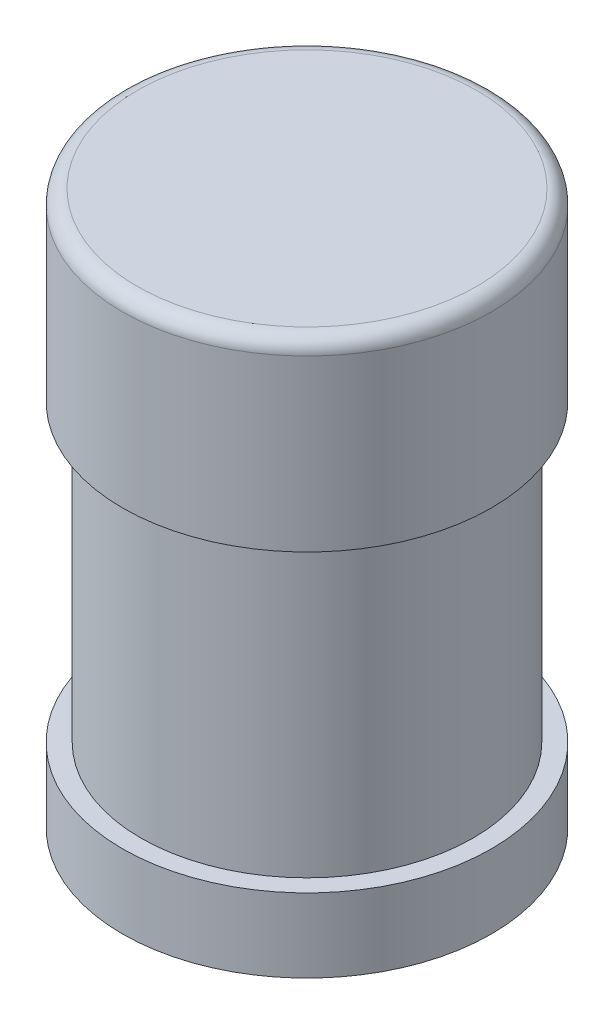
ISO-10303-21;
HEADER;
FILE_DESCRIPTION(('STEP AP214'),'2;1');
FILE_NAME('part.step','',(''),(''),'','','');
FILE_SCHEMA(('AUTOMOTIVE_DESIGN { 1 0 10303 214 1 1 1 1 }'));
ENDSEC;
DATA;
#1=APPLICATION_CONTEXT('core data for automotive mechanical design processes');
#2=APPLICATION_PROTOCOL_DEFINITION('international standard','automotive_design',2000,#1);
#3=PRODUCT_CONTEXT('',#1,'mechanical');
#4=PRODUCT('Part','Part','',(#3));
#5=PRODUCT_RELATED_PRODUCT_CATEGORY('part','',(#4));
#6=PRODUCT_DEFINITION_FORMATION('','',#4);
#7=PRODUCT_DEFINITION_CONTEXT('part definition',#1,'design');
#8=PRODUCT_DEFINITION('design','',#6,#7);
#9=PRODUCT_DEFINITION_SHAPE('','',#8);
#10=(LENGTH_UNIT() NAMED_UNIT(*) SI_UNIT(.MILLI.,.METRE.));
#11=(NAMED_UNIT(*) PLANE_ANGLE_UNIT() SI_UNIT($,.RADIAN.));
#12=(NAMED_UNIT(*) SI_UNIT($,.STERADIAN.) SOLID_ANGLE_UNIT());
#13=UNCERTAINTY_MEASURE_WITH_UNIT(LENGTH_MEASURE(1.E-05),#10,'distance_accuracy_value','');
#14=(GEOMETRIC_REPRESENTATION_CONTEXT(3) GLOBAL_UNCERTAINTY_ASSIGNED_CONTEXT((#13)) GLOBAL_UNIT_ASSIGNED_CONTEXT((#10,
#11,#12)) REPRESENTATION_CONTEXT('',''));
#15=CARTESIAN_POINT('',(0.,0.,0.));
#16=DIRECTION('',(0.,0.,1.));
#17=DIRECTION('',(1.,0.,0.));
#18=AXIS2_PLACEMENT_3D('',#15,#16,#17);
#19=CARTESIAN_POINT('',(0.,15.,0.));
#20=DIRECTION('',(0.,-1.,0.));
#21=DIRECTION('',(0.,0.,-1.));
#22=AXIS2_PLACEMENT_3D('',#19,#20,#21);
#23=PLANE('',#22);
#24=CARTESIAN_POINT('',(0.,15.,0.));
#25=DIRECTION('',(0.,-1.,0.));
#26=DIRECTION('',(0.,0.,-1.));
#27=AXIS2_PLACEMENT_3D('',#24,#25,#26);
#28=CIRCLE('',#27,4.6);
#29=CARTESIAN_POINT('',(0.,15.,-4.6));
#30=VERTEX_POINT('',#29);
#31=EDGE_CURVE('E57',#30,#30,#28,.F.);
#32=ORIENTED_EDGE('',*,*,#31,.T.);
#33=EDGE_LOOP('',(#32));
#34=FACE_BOUND('',#33,.T.);
#35=ADVANCED_FACE('F37',(#34),#23,.F.);
#36=CARTESIAN_POINT('',(0.,0.,0.));
#37=DIRECTION('',(0.,-1.,0.));
#38=DIRECTION('',(0.,0.,-1.));
#39=AXIS2_PLACEMENT_3D('',#36,#37,#38);
#40=CYLINDRICAL_SURFACE('',#39,5.);
#41=CARTESIAN_POINT('',(0.,14.6,0.));
#42=DIRECTION('',(0.,-1.,0.));
#43=DIRECTION('',(0.,0.,-1.));
#44=AXIS2_PLACEMENT_3D('',#41,#42,#43);
#45=CIRCLE('',#44,5.);
#46=CARTESIAN_POINT('',(0.,14.6,-5.));
#47=VERTEX_POINT('',#46);
#48=EDGE_CURVE('E60',#47,#47,#45,.T.);
#49=ORIENTED_EDGE('',*,*,#48,.T.);
#50=EDGE_LOOP('',(#49));
#51=FACE_BOUND('',#50,.T.);
#52=CARTESIAN_POINT('',(0.,10.,0.));
#53=DIRECTION('',(0.,-1.,0.));
#54=DIRECTION('',(0.,0.,-1.));
#55=AXIS2_PLACEMENT_3D('',#52,#53,#54);
#56=CIRCLE('',#55,5.);
#57=CARTESIAN_POINT('',(0.,10.,-5.));
#58=VERTEX_POINT('',#57);
#59=EDGE_CURVE('E63',#58,#58,#56,.T.);
#60=ORIENTED_EDGE('',*,*,#59,.F.);
#61=EDGE_LOOP('',(#60));
#62=FACE_BOUND('',#61,.T.);
#63=ADVANCED_FACE('F107',(#51,#62),#40,.T.);
#64=CARTESIAN_POINT('',(-5.,10.,0.));
#65=DIRECTION('',(0.,1.,0.));
#66=DIRECTION('',(0.,0.,1.));
#67=AXIS2_PLACEMENT_3D('',#64,#65,#66);
#68=PLANE('',#67);
#69=CARTESIAN_POINT('',(0.,10.,0.));
#70=DIRECTION('',(0.,-1.,0.));
#71=DIRECTION('',(0.,0.,-1.));
#72=AXIS2_PLACEMENT_3D('',#69,#70,#71);
#73=CIRCLE('',#72,4.5);
#74=CARTESIAN_POINT('',(0.,10.,-4.5));
#75=VERTEX_POINT('',#74);
#76=EDGE_CURVE('E66',#75,#75,#73,.T.);
#77=ORIENTED_EDGE('',*,*,#76,.F.);
#78=EDGE_LOOP('',(#77));
#79=FACE_BOUND('',#78,.T.);
#80=ORIENTED_EDGE('',*,*,#59,.T.);
#81=EDGE_LOOP('',(#80));
#82=FACE_BOUND('',#81,.T.);
#83=ADVANCED_FACE('F113',(#79,#82),#68,.F.);
#84=CARTESIAN_POINT('',(0.,0.,0.));
#85=DIRECTION('',(0.,-1.,0.));
#86=DIRECTION('',(0.,0.,-1.));
#87=AXIS2_PLACEMENT_3D('',#84,#85,#86);
#88=CYLINDRICAL_SURFACE('',#87,4.5);
#89=CARTESIAN_POINT('',(0.,2.,0.));
#90=DIRECTION('',(0.,-1.,0.));
#91=DIRECTION('',(0.,0.,-1.));
#92=AXIS2_PLACEMENT_3D('',#89,#90,#91);
#93=CIRCLE('',#92,4.5);
#94=CARTESIAN_POINT('',(0.,2.,-4.5));
#95=VERTEX_POINT('',#94);
#96=EDGE_CURVE('E69',#95,#95,#93,.T.);
#97=ORIENTED_EDGE('',*,*,#96,.F.);
#98=EDGE_LOOP('',(#97));
#99=FACE_BOUND('',#98,.T.);
#100=ORIENTED_EDGE('',*,*,#76,.T.);
#101=EDGE_LOOP('',(#100));
#102=FACE_BOUND('',#101,.T.);
#103=ADVANCED_FACE('F155',(#99,#102),#88,.T.);
#104=CARTESIAN_POINT('',(-4.5,2.,0.));
#105=DIRECTION('',(0.,-1.,0.));
#106=DIRECTION('',(0.,0.,-1.));
#107=AXIS2_PLACEMENT_3D('',#104,#105,#106);
#108=PLANE('',#107);
#109=CARTESIAN_POINT('',(0.,2.,0.));
#110=DIRECTION('',(0.,-1.,0.));
#111=DIRECTION('',(0.,0.,-1.));
#112=AXIS2_PLACEMENT_3D('',#109,#110,#111);
#113=CIRCLE('',#112,5.);
#114=CARTESIAN_POINT('',(0.,2.,-5.));
#115=VERTEX_POINT('',#114);
#116=EDGE_CURVE('E72',#115,#115,#113,.T.);
#117=ORIENTED_EDGE('',*,*,#116,.F.);
#118=EDGE_LOOP('',(#117));
#119=FACE_BOUND('',#118,.T.);
#120=ORIENTED_EDGE('',*,*,#96,.T.);
#121=EDGE_LOOP('',(#120));
#122=FACE_BOUND('',#121,.T.);
#123=ADVANCED_FACE('F151',(#119,#122),#108,.F.);
#124=CARTESIAN_POINT('',(0.,0.,0.));
#125=DIRECTION('',(0.,-1.,0.));
#126=DIRECTION('',(0.,0.,-1.));
#127=AXIS2_PLACEMENT_3D('',#124,#125,#126);
#128=CYLINDRICAL_SURFACE('',#127,5.);
#129=CARTESIAN_POINT('',(0.,0.,0.));
#130=DIRECTION('',(0.,-1.,0.));
#131=DIRECTION('',(0.,0.,-1.));
#132=AXIS2_PLACEMENT_3D('',#129,#130,#131);
#133=CIRCLE('',#132,5.);
#134=CARTESIAN_POINT('',(0.,0.,-5.));
#135=VERTEX_POINT('',#134);
#136=EDGE_CURVE('E75',#135,#135,#133,.T.);
#137=ORIENTED_EDGE('',*,*,#136,.F.);
#138=EDGE_LOOP('',(#137));
#139=FACE_BOUND('',#138,.T.);
#140=ORIENTED_EDGE('',*,*,#116,.T.);
#141=EDGE_LOOP('',(#140));
#142=FACE_BOUND('',#141,.T.);
#143=ADVANCED_FACE('F147',(#139,#142),#128,.T.);
#144=CARTESIAN_POINT('',(-5.,0.,0.));
#145=DIRECTION('',(0.,1.,0.));
#146=DIRECTION('',(0.,0.,1.));
#147=AXIS2_PLACEMENT_3D('',#144,#145,#146);
#148=PLANE('',#147);
#149=CARTESIAN_POINT('',(0.,0.,0.));
#150=DIRECTION('',(0.,1.,0.));
#151=DIRECTION('',(0.,0.,1.));
#152=AXIS2_PLACEMENT_3D('',#149,#150,#151);
#153=CIRCLE('',#152,4.);
#154=CARTESIAN_POINT('',(0.,0.,4.));
#155=VERTEX_POINT('',#154);
#156=EDGE_CURVE('E79',#155,#155,#153,.F.);
#157=ORIENTED_EDGE('',*,*,#156,.F.);
#158=EDGE_LOOP('',(#157));
#159=FACE_BOUND('',#158,.T.);
#160=ORIENTED_EDGE('',*,*,#136,.T.);
#161=EDGE_LOOP('',(#160));
#162=FACE_BOUND('',#161,.T.);
#163=ADVANCED_FACE('F104',(#159,#162),#148,.F.);
#164=CARTESIAN_POINT('',(0.,14.,0.));
#165=DIRECTION('',(0.,-1.,0.));
#166=DIRECTION('',(0.,0.,-1.));
#167=AXIS2_PLACEMENT_3D('',#164,#165,#166);
#168=PLANE('',#167);
#169=CARTESIAN_POINT('',(0.,14.,0.));
#170=DIRECTION('',(0.,-1.,0.));
#171=DIRECTION('',(0.,0.,-1.));
#172=AXIS2_PLACEMENT_3D('',#169,#170,#171);
#173=CIRCLE('',#172,4.);
#174=CARTESIAN_POINT('',(0.,14.,-4.));
#175=VERTEX_POINT('',#174);
#176=EDGE_CURVE('E78',#175,#175,#173,.T.);
#177=ORIENTED_EDGE('',*,*,#176,.T.);
#178=EDGE_LOOP('',(#177));
#179=FACE_BOUND('',#178,.T.);
#180=ADVANCED_FACE('F91',(#179),#168,.T.);
#181=CARTESIAN_POINT('',(0.,0.,0.));
#182=DIRECTION('',(0.,-1.,0.));
#183=DIRECTION('',(0.,0.,-1.));
#184=AXIS2_PLACEMENT_3D('',#181,#182,#183);
#185=CYLINDRICAL_SURFACE('',#184,4.);
#186=CARTESIAN_POINT('',(0.,11.,0.));
#187=DIRECTION('',(0.,1.,0.));
#188=DIRECTION('',(0.,0.,1.));
#189=AXIS2_PLACEMENT_3D('',#186,#187,#188);
#190=CIRCLE('',#189,4.);
#191=CARTESIAN_POINT('',(0.,11.,4.));
#192=VERTEX_POINT('',#191);
#193=EDGE_CURVE('E85',#192,#192,#190,.F.);
#194=ORIENTED_EDGE('',*,*,#193,.T.);
#195=EDGE_LOOP('',(#194));
#196=FACE_BOUND('',#195,.T.);
#197=ORIENTED_EDGE('',*,*,#176,.F.);
#198=EDGE_LOOP('',(#197));
#199=FACE_BOUND('',#198,.T.);
#200=ADVANCED_FACE('F93',(#196,#199),#185,.F.);
#201=CARTESIAN_POINT('',(-5.,11.,0.));
#202=DIRECTION('',(0.,1.,0.));
#203=DIRECTION('',(0.,0.,1.));
#204=AXIS2_PLACEMENT_3D('',#201,#202,#203);
#205=PLANE('',#204);
#206=CARTESIAN_POINT('',(0.,11.,0.));
#207=DIRECTION('',(0.,1.,0.));
#208=DIRECTION('',(0.,0.,1.));
#209=AXIS2_PLACEMENT_3D('',#206,#207,#208);
#210=CIRCLE('',#209,3.9);
#211=CARTESIAN_POINT('',(0.,11.,3.9));
#212=VERTEX_POINT('',#211);
#213=EDGE_CURVE('E44',#212,#212,#210,.F.);
#214=ORIENTED_EDGE('',*,*,#213,.T.);
#215=EDGE_LOOP('',(#214));
#216=FACE_BOUND('',#215,.T.);
#217=ORIENTED_EDGE('',*,*,#193,.F.);
#218=EDGE_LOOP('',(#217));
#219=FACE_BOUND('',#218,.T.);
#220=ADVANCED_FACE('F95',(#216,#219),#205,.T.);
#221=CARTESIAN_POINT('',(0.,0.,0.));
#222=DIRECTION('',(0.,-1.,0.));
#223=DIRECTION('',(0.,0.,-1.));
#224=AXIS2_PLACEMENT_3D('',#221,#222,#223);
#225=CYLINDRICAL_SURFACE('',#224,3.5);
#226=CARTESIAN_POINT('',(0.,10.6,0.));
#227=DIRECTION('',(0.,1.,0.));
#228=DIRECTION('',(0.,0.,1.));
#229=AXIS2_PLACEMENT_3D('',#226,#227,#228);
#230=CIRCLE('',#229,3.5);
#231=CARTESIAN_POINT('',(0.,10.6,3.5));
#232=VERTEX_POINT('',#231);
#233=EDGE_CURVE('E10',#232,#232,#230,.T.);
#234=ORIENTED_EDGE('',*,*,#233,.T.);
#235=EDGE_LOOP('',(#234));
#236=FACE_BOUND('',#235,.T.);
#237=CARTESIAN_POINT('',(0.,1.4,0.));
#238=DIRECTION('',(0.,-1.,0.));
#239=DIRECTION('',(0.,0.,-1.));
#240=AXIS2_PLACEMENT_3D('',#237,#238,#239);
#241=CIRCLE('',#240,3.5);
#242=CARTESIAN_POINT('',(0.,1.4,-3.5));
#243=VERTEX_POINT('',#242);
#244=EDGE_CURVE('E52',#243,#243,#241,.T.);
#245=ORIENTED_EDGE('',*,*,#244,.T.);
#246=EDGE_LOOP('',(#245));
#247=FACE_BOUND('',#246,.T.);
#248=ADVANCED_FACE('F102',(#236,#247),#225,.F.);
#249=CARTESIAN_POINT('',(-4.5,1.,0.));
#250=DIRECTION('',(0.,-1.,0.));
#251=DIRECTION('',(0.,0.,-1.));
#252=AXIS2_PLACEMENT_3D('',#249,#250,#251);
#253=PLANE('',#252);
#254=CARTESIAN_POINT('',(0.,1.,0.));
#255=DIRECTION('',(0.,-1.,0.));
#256=DIRECTION('',(0.,0.,-1.));
#257=AXIS2_PLACEMENT_3D('',#254,#255,#256);
#258=CIRCLE('',#257,3.9);
#259=CARTESIAN_POINT('',(0.,1.,-3.9));
#260=VERTEX_POINT('',#259);
#261=EDGE_CURVE('E48',#260,#260,#258,.F.);
#262=ORIENTED_EDGE('',*,*,#261,.T.);
#263=EDGE_LOOP('',(#262));
#264=FACE_BOUND('',#263,.T.);
#265=CARTESIAN_POINT('',(0.,1.,0.));
#266=DIRECTION('',(0.,-1.,0.));
#267=DIRECTION('',(0.,0.,-1.));
#268=AXIS2_PLACEMENT_3D('',#265,#266,#267);
#269=CIRCLE('',#268,4.);
#270=CARTESIAN_POINT('',(0.,1.,-4.));
#271=VERTEX_POINT('',#270);
#272=EDGE_CURVE('E82',#271,#271,#269,.T.);
#273=ORIENTED_EDGE('',*,*,#272,.T.);
#274=EDGE_LOOP('',(#273));
#275=FACE_BOUND('',#274,.T.);
#276=ADVANCED_FACE('F134',(#264,#275),#253,.T.);
#277=CARTESIAN_POINT('',(0.,0.,0.));
#278=DIRECTION('',(0.,-1.,0.));
#279=DIRECTION('',(0.,0.,-1.));
#280=AXIS2_PLACEMENT_3D('',#277,#278,#279);
#281=CYLINDRICAL_SURFACE('',#280,4.);
#282=ORIENTED_EDGE('',*,*,#156,.T.);
#283=EDGE_LOOP('',(#282));
#284=FACE_BOUND('',#283,.T.);
#285=ORIENTED_EDGE('',*,*,#272,.F.);
#286=EDGE_LOOP('',(#285));
#287=FACE_BOUND('',#286,.T.);
#288=ADVANCED_FACE('F121',(#284,#287),#281,.F.);
#289=CARTESIAN_POINT('',(0.,14.6,0.));
#290=DIRECTION('',(0.,-1.,0.));
#291=DIRECTION('',(0.,0.,-1.));
#292=AXIS2_PLACEMENT_3D('',#289,#290,#291);
#293=TOROIDAL_SURFACE('',#292,4.6,0.4);
#294=ORIENTED_EDGE('',*,*,#31,.F.);
#295=EDGE_LOOP('',(#294));
#296=FACE_BOUND('',#295,.T.);
#297=ORIENTED_EDGE('',*,*,#48,.F.);
#298=EDGE_LOOP('',(#297));
#299=FACE_BOUND('',#298,.T.);
#300=ADVANCED_FACE('F118',(#296,#299),#293,.T.);
#301=CARTESIAN_POINT('',(0.,1.4,0.));
#302=DIRECTION('',(0.,-1.,0.));
#303=DIRECTION('',(0.,0.,-1.));
#304=AXIS2_PLACEMENT_3D('',#301,#302,#303);
#305=TOROIDAL_SURFACE('',#304,3.9,0.4);
#306=ORIENTED_EDGE('',*,*,#261,.F.);
#307=EDGE_LOOP('',(#306));
#308=FACE_BOUND('',#307,.T.);
#309=ORIENTED_EDGE('',*,*,#244,.F.);
#310=EDGE_LOOP('',(#309));
#311=FACE_BOUND('',#310,.T.);
#312=ADVANCED_FACE('F120',(#308,#311),#305,.T.);
#313=CARTESIAN_POINT('',(0.,10.6,0.));
#314=DIRECTION('',(0.,1.,0.));
#315=DIRECTION('',(0.,0.,1.));
#316=AXIS2_PLACEMENT_3D('',#313,#314,#315);
#317=TOROIDAL_SURFACE('',#316,3.9,0.4);
#318=ORIENTED_EDGE('',*,*,#233,.F.);
#319=EDGE_LOOP('',(#318));
#320=FACE_BOUND('',#319,.T.);
#321=ORIENTED_EDGE('',*,*,#213,.F.);
#322=EDGE_LOOP('',(#321));
#323=FACE_BOUND('',#322,.T.);
#324=ADVANCED_FACE('F39',(#320,#323),#317,.T.);
#325=CLOSED_SHELL('',(#35,#63,#83,#103,#123,#143,#163,#180,#200,#220,#248,#276,#288,#300,#312,#324));
#326=MANIFOLD_SOLID_BREP('B2',#325);
#327=ADVANCED_BREP_SHAPE_REPRESENTATION('',(#18,#326),#14);
#328=SHAPE_DEFINITION_REPRESENTATION(#9,#327);
ENDSEC;
END-ISO-10303-21;
